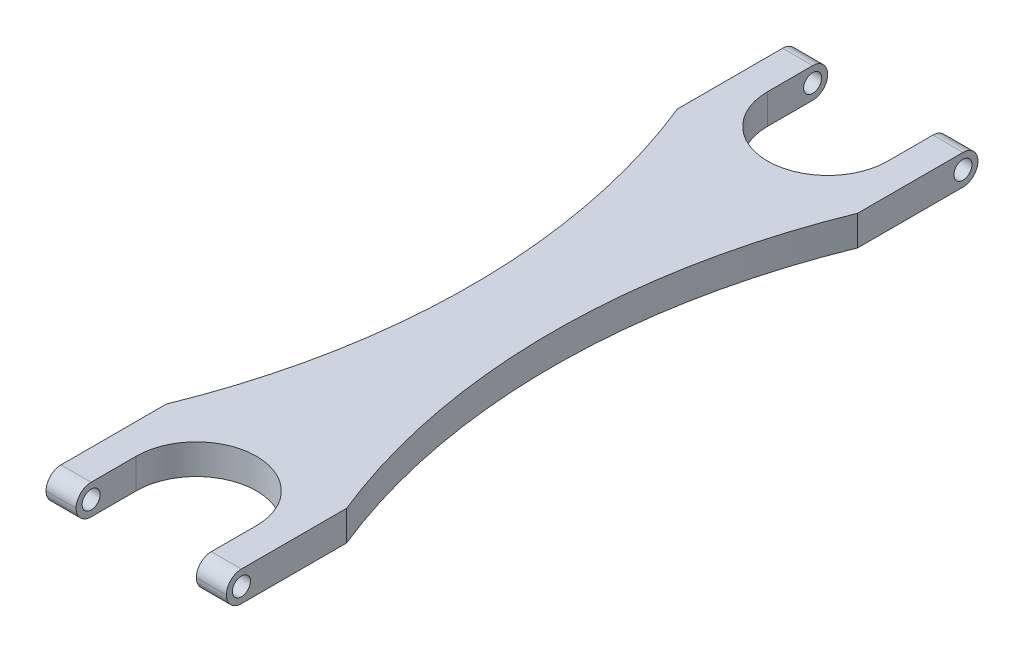
ISO-10303-21;
HEADER;
FILE_DESCRIPTION(('STEP AP214'),'2;1');
FILE_NAME('part.step','',(''),(''),'','','');
FILE_SCHEMA(('AUTOMOTIVE_DESIGN { 1 0 10303 214 1 1 1 1 }'));
ENDSEC;
DATA;
#1=APPLICATION_CONTEXT('core data for automotive mechanical design processes');
#2=APPLICATION_PROTOCOL_DEFINITION('international standard','automotive_design',2000,#1);
#3=PRODUCT_CONTEXT('',#1,'mechanical');
#4=PRODUCT('Part','Part','',(#3));
#5=PRODUCT_RELATED_PRODUCT_CATEGORY('part','',(#4));
#6=PRODUCT_DEFINITION_FORMATION('','',#4);
#7=PRODUCT_DEFINITION_CONTEXT('part definition',#1,'design');
#8=PRODUCT_DEFINITION('design','',#6,#7);
#9=PRODUCT_DEFINITION_SHAPE('','',#8);
#10=(LENGTH_UNIT() NAMED_UNIT(*) SI_UNIT(.MILLI.,.METRE.));
#11=(NAMED_UNIT(*) PLANE_ANGLE_UNIT() SI_UNIT($,.RADIAN.));
#12=(NAMED_UNIT(*) SI_UNIT($,.STERADIAN.) SOLID_ANGLE_UNIT());
#13=UNCERTAINTY_MEASURE_WITH_UNIT(LENGTH_MEASURE(1.E-05),#10,'distance_accuracy_value','');
#14=(GEOMETRIC_REPRESENTATION_CONTEXT(3) GLOBAL_UNCERTAINTY_ASSIGNED_CONTEXT((#13)) GLOBAL_UNIT_ASSIGNED_CONTEXT((#10,
#11,#12)) REPRESENTATION_CONTEXT('',''));
#15=CARTESIAN_POINT('',(0.,0.,0.));
#16=DIRECTION('',(0.,0.,1.));
#17=DIRECTION('',(1.,0.,0.));
#18=AXIS2_PLACEMENT_3D('',#15,#16,#17);
#19=CARTESIAN_POINT('',(0.,12.7,0.));
#20=DIRECTION('',(1.,0.,0.));
#21=DIRECTION('',(0.,0.,-1.));
#22=AXIS2_PLACEMENT_3D('',#19,#20,#21);
#23=PLANE('',#22);
#24=CARTESIAN_POINT('',(-1.11022302462516E-13,6.35,6.35000000000003));
#25=DIRECTION('',(1.,0.,0.));
#26=DIRECTION('',(0.,0.,-1.));
#27=AXIS2_PLACEMENT_3D('',#24,#25,#26);
#28=CIRCLE('',#27,3.81);
#29=CARTESIAN_POINT('',(-1.12410081243297E-13,6.35,2.54000000000003));
#30=VERTEX_POINT('',#29);
#31=EDGE_CURVE('E643',#30,#30,#28,.T.);
#32=ORIENTED_EDGE('',*,*,#31,.T.);
#33=EDGE_LOOP('',(#32));
#34=FACE_BOUND('',#33,.T.);
#35=CARTESIAN_POINT('',(0.,6.35,6.34999999999999));
#36=DIRECTION('',(1.,0.,0.));
#37=DIRECTION('',(0.,0.,-1.));
#38=AXIS2_PLACEMENT_3D('',#35,#36,#37);
#39=CIRCLE('',#38,6.35);
#40=CARTESIAN_POINT('',(0.,12.7,6.34999999999999));
#41=VERTEX_POINT('',#40);
#42=CARTESIAN_POINT('',(0.,6.35,0.));
#43=VERTEX_POINT('',#42);
#44=EDGE_CURVE('E221',#41,#43,#39,.F.);
#45=ORIENTED_EDGE('',*,*,#44,.T.);
#46=CARTESIAN_POINT('',(0.,6.35,6.35));
#47=DIRECTION('',(1.,0.,0.));
#48=DIRECTION('',(0.,0.,-1.));
#49=AXIS2_PLACEMENT_3D('',#46,#47,#48);
#50=CIRCLE('',#49,6.35);
#51=CARTESIAN_POINT('',(0.,0.,6.35));
#52=VERTEX_POINT('',#51);
#53=EDGE_CURVE('E223',#43,#52,#50,.F.);
#54=ORIENTED_EDGE('',*,*,#53,.T.);
#55=DIRECTION('',(0.,0.,1.));
#56=VECTOR('',#55,1.);
#57=CARTESIAN_POINT('',(0.,0.,0.));
#58=LINE('',#57,#56);
#59=CARTESIAN_POINT('',(0.,0.,50.8));
#60=VERTEX_POINT('',#59);
#61=EDGE_CURVE('E194',#52,#60,#58,.T.);
#62=ORIENTED_EDGE('',*,*,#61,.T.);
#63=DIRECTION('',(0.,-1.,0.));
#64=VECTOR('',#63,1.);
#65=CARTESIAN_POINT('',(0.,12.7,50.8));
#66=LINE('',#65,#64);
#67=CARTESIAN_POINT('',(0.,12.7,50.8));
#68=VERTEX_POINT('',#67);
#69=EDGE_CURVE('E187',#68,#60,#66,.T.);
#70=ORIENTED_EDGE('',*,*,#69,.F.);
#71=DIRECTION('',(0.,0.,1.));
#72=VECTOR('',#71,1.);
#73=CARTESIAN_POINT('',(0.,12.7,0.));
#74=LINE('',#73,#72);
#75=EDGE_CURVE('E169',#41,#68,#74,.T.);
#76=ORIENTED_EDGE('',*,*,#75,.F.);
#77=EDGE_LOOP('',(#45,#54,#62,#70,#76));
#78=FACE_BOUND('',#77,.T.);
#79=ADVANCED_FACE('F32',(#34,#78),#23,.F.);
#80=CARTESIAN_POINT('',(-266.7,12.7,158.75));
#81=DIRECTION('',(0.,-1.,0.));
#82=DIRECTION('',(0.,0.,-1.));
#83=AXIS2_PLACEMENT_3D('',#80,#81,#82);
#84=CYLINDRICAL_SURFACE('',#83,287.718773283913);
#85=CARTESIAN_POINT('',(-266.7,0.,158.75));
#86=DIRECTION('',(0.,-1.,0.));
#87=DIRECTION('',(0.,0.,-1.));
#88=AXIS2_PLACEMENT_3D('',#85,#86,#87);
#89=CIRCLE('',#88,287.718773283913);
#90=CARTESIAN_POINT('',(0.,0.,266.7));
#91=VERTEX_POINT('',#90);
#92=EDGE_CURVE('E293',#60,#91,#89,.T.);
#93=ORIENTED_EDGE('',*,*,#92,.T.);
#94=DIRECTION('',(0.,-1.,0.));
#95=VECTOR('',#94,1.);
#96=CARTESIAN_POINT('',(0.,12.7,266.7));
#97=LINE('',#96,#95);
#98=CARTESIAN_POINT('',(0.,12.7,266.7));
#99=VERTEX_POINT('',#98);
#100=EDGE_CURVE('E189',#99,#91,#97,.T.);
#101=ORIENTED_EDGE('',*,*,#100,.F.);
#102=CARTESIAN_POINT('',(-266.7,12.7,158.75));
#103=DIRECTION('',(0.,-1.,0.));
#104=DIRECTION('',(0.,0.,-1.));
#105=AXIS2_PLACEMENT_3D('',#102,#103,#104);
#106=CIRCLE('',#105,287.718773283913);
#107=EDGE_CURVE('E174',#68,#99,#106,.T.);
#108=ORIENTED_EDGE('',*,*,#107,.F.);
#109=ORIENTED_EDGE('',*,*,#69,.T.);
#110=EDGE_LOOP('',(#93,#101,#108,#109));
#111=FACE_BOUND('',#110,.T.);
#112=ADVANCED_FACE('F186',(#111),#84,.F.);
#113=CARTESIAN_POINT('',(0.,12.7,266.7));
#114=DIRECTION('',(1.,0.,0.));
#115=DIRECTION('',(0.,0.,-1.));
#116=AXIS2_PLACEMENT_3D('',#113,#114,#115);
#117=PLANE('',#116);
#118=CARTESIAN_POINT('',(0.,6.35,311.15));
#119=DIRECTION('',(1.,0.,0.));
#120=DIRECTION('',(0.,0.,-1.));
#121=AXIS2_PLACEMENT_3D('',#118,#119,#120);
#122=CIRCLE('',#121,3.81000000000004);
#123=CARTESIAN_POINT('',(0.,6.35,307.34));
#124=VERTEX_POINT('',#123);
#125=EDGE_CURVE('E267',#124,#124,#122,.T.);
#126=ORIENTED_EDGE('',*,*,#125,.T.);
#127=EDGE_LOOP('',(#126));
#128=FACE_BOUND('',#127,.T.);
#129=DIRECTION('',(0.,0.,1.));
#130=VECTOR('',#129,1.);
#131=CARTESIAN_POINT('',(0.,0.,266.7));
#132=LINE('',#131,#130);
#133=CARTESIAN_POINT('',(0.,0.,311.15));
#134=VERTEX_POINT('',#133);
#135=EDGE_CURVE('E295',#91,#134,#132,.T.);
#136=ORIENTED_EDGE('',*,*,#135,.T.);
#137=CARTESIAN_POINT('',(0.,6.35,311.15));
#138=DIRECTION('',(1.,0.,0.));
#139=DIRECTION('',(0.,0.,-1.));
#140=AXIS2_PLACEMENT_3D('',#137,#138,#139);
#141=CIRCLE('',#140,6.35);
#142=CARTESIAN_POINT('',(0.,6.35,317.5));
#143=VERTEX_POINT('',#142);
#144=EDGE_CURVE('E242',#134,#143,#141,.F.);
#145=ORIENTED_EDGE('',*,*,#144,.T.);
#146=CARTESIAN_POINT('',(0.,6.35,311.15));
#147=DIRECTION('',(1.,0.,0.));
#148=DIRECTION('',(0.,0.,-1.));
#149=AXIS2_PLACEMENT_3D('',#146,#147,#148);
#150=CIRCLE('',#149,6.35);
#151=CARTESIAN_POINT('',(0.,12.7,311.15));
#152=VERTEX_POINT('',#151);
#153=EDGE_CURVE('E240',#143,#152,#150,.F.);
#154=ORIENTED_EDGE('',*,*,#153,.T.);
#155=DIRECTION('',(0.,0.,1.));
#156=VECTOR('',#155,1.);
#157=CARTESIAN_POINT('',(0.,12.7,266.7));
#158=LINE('',#157,#156);
#159=EDGE_CURVE('E191',#99,#152,#158,.T.);
#160=ORIENTED_EDGE('',*,*,#159,.F.);
#161=ORIENTED_EDGE('',*,*,#100,.T.);
#162=EDGE_LOOP('',(#136,#145,#154,#160,#161));
#163=FACE_BOUND('',#162,.T.);
#164=ADVANCED_FACE('F396',(#128,#163),#117,.F.);
#165=CARTESIAN_POINT('',(12.7,12.7,317.5));
#166=DIRECTION('',(-1.,0.,0.));
#167=DIRECTION('',(0.,0.,1.));
#168=AXIS2_PLACEMENT_3D('',#165,#166,#167);
#169=PLANE('',#168);
#170=CARTESIAN_POINT('',(12.7,6.35,311.15));
#171=DIRECTION('',(-1.,0.,0.));
#172=DIRECTION('',(0.,0.,1.));
#173=AXIS2_PLACEMENT_3D('',#170,#171,#172);
#174=CIRCLE('',#173,3.81000000000004);
#175=CARTESIAN_POINT('',(12.7,6.35,314.96));
#176=VERTEX_POINT('',#175);
#177=EDGE_CURVE('E258',#176,#176,#174,.T.);
#178=ORIENTED_EDGE('',*,*,#177,.T.);
#179=EDGE_LOOP('',(#178));
#180=FACE_BOUND('',#179,.T.);
#181=CARTESIAN_POINT('',(12.7,6.35,311.15));
#182=DIRECTION('',(-1.,0.,0.));
#183=DIRECTION('',(0.,0.,1.));
#184=AXIS2_PLACEMENT_3D('',#181,#182,#183);
#185=CIRCLE('',#184,6.35);
#186=CARTESIAN_POINT('',(12.7,12.7,311.15));
#187=VERTEX_POINT('',#186);
#188=CARTESIAN_POINT('',(12.7,6.35,317.5));
#189=VERTEX_POINT('',#188);
#190=EDGE_CURVE('E236',#187,#189,#185,.F.);
#191=ORIENTED_EDGE('',*,*,#190,.T.);
#192=CARTESIAN_POINT('',(12.7,6.35,311.15));
#193=DIRECTION('',(-1.,0.,0.));
#194=DIRECTION('',(0.,0.,1.));
#195=AXIS2_PLACEMENT_3D('',#192,#193,#194);
#196=CIRCLE('',#195,6.35);
#197=CARTESIAN_POINT('',(12.7,0.,311.15));
#198=VERTEX_POINT('',#197);
#199=EDGE_CURVE('E238',#189,#198,#196,.F.);
#200=ORIENTED_EDGE('',*,*,#199,.T.);
#201=DIRECTION('',(0.,0.,-1.));
#202=VECTOR('',#201,1.);
#203=CARTESIAN_POINT('',(12.7,0.,317.5));
#204=LINE('',#203,#202);
#205=CARTESIAN_POINT('',(12.7,0.,292.1));
#206=VERTEX_POINT('',#205);
#207=EDGE_CURVE('E298',#198,#206,#204,.T.);
#208=ORIENTED_EDGE('',*,*,#207,.T.);
#209=DIRECTION('',(0.,-1.,0.));
#210=VECTOR('',#209,1.);
#211=CARTESIAN_POINT('',(12.7,12.7,292.1));
#212=LINE('',#211,#210);
#213=CARTESIAN_POINT('',(12.7,12.7,292.1));
#214=VERTEX_POINT('',#213);
#215=EDGE_CURVE('E200',#214,#206,#212,.T.);
#216=ORIENTED_EDGE('',*,*,#215,.F.);
#217=DIRECTION('',(0.,0.,-1.));
#218=VECTOR('',#217,1.);
#219=CARTESIAN_POINT('',(12.7,12.7,317.5));
#220=LINE('',#219,#218);
#221=EDGE_CURVE('E272',#187,#214,#220,.T.);
#222=ORIENTED_EDGE('',*,*,#221,.F.);
#223=EDGE_LOOP('',(#191,#200,#208,#216,#222));
#224=FACE_BOUND('',#223,.T.);
#225=ADVANCED_FACE('F339',(#180,#224),#169,.F.);
#226=CARTESIAN_POINT('',(38.1,12.7,292.1));
#227=DIRECTION('',(0.,-1.,0.));
#228=DIRECTION('',(0.,0.,-1.));
#229=AXIS2_PLACEMENT_3D('',#226,#227,#228);
#230=CYLINDRICAL_SURFACE('',#229,25.4);
#231=CARTESIAN_POINT('',(38.1,0.,292.1));
#232=DIRECTION('',(0.,-1.,0.));
#233=DIRECTION('',(0.,0.,1.));
#234=AXIS2_PLACEMENT_3D('',#231,#232,#233);
#235=CIRCLE('',#234,25.4);
#236=CARTESIAN_POINT('',(63.5,0.,292.1));
#237=VERTEX_POINT('',#236);
#238=EDGE_CURVE('E300',#206,#237,#235,.T.);
#239=ORIENTED_EDGE('',*,*,#238,.T.);
#240=DIRECTION('',(0.,-1.,0.));
#241=VECTOR('',#240,1.);
#242=CARTESIAN_POINT('',(63.5,12.7,292.1));
#243=LINE('',#242,#241);
#244=CARTESIAN_POINT('',(63.5,12.7,292.1));
#245=VERTEX_POINT('',#244);
#246=EDGE_CURVE('E328',#245,#237,#243,.T.);
#247=ORIENTED_EDGE('',*,*,#246,.F.);
#248=CARTESIAN_POINT('',(38.1,12.7,292.1));
#249=DIRECTION('',(0.,-1.,0.));
#250=DIRECTION('',(0.,0.,-1.));
#251=AXIS2_PLACEMENT_3D('',#248,#249,#250);
#252=CIRCLE('',#251,25.4);
#253=EDGE_CURVE('E274',#214,#245,#252,.T.);
#254=ORIENTED_EDGE('',*,*,#253,.F.);
#255=ORIENTED_EDGE('',*,*,#215,.T.);
#256=EDGE_LOOP('',(#239,#247,#254,#255));
#257=FACE_BOUND('',#256,.T.);
#258=ADVANCED_FACE('F334',(#257),#230,.F.);
#259=CARTESIAN_POINT('',(63.5,12.7,317.5));
#260=DIRECTION('',(1.,0.,0.));
#261=DIRECTION('',(0.,0.,-1.));
#262=AXIS2_PLACEMENT_3D('',#259,#260,#261);
#263=PLANE('',#262);
#264=CARTESIAN_POINT('',(63.5,6.35,311.15));
#265=DIRECTION('',(1.,0.,0.));
#266=DIRECTION('',(0.,0.,-1.));
#267=AXIS2_PLACEMENT_3D('',#264,#265,#266);
#268=CIRCLE('',#267,3.81000000000004);
#269=CARTESIAN_POINT('',(63.5,6.35,307.34));
#270=VERTEX_POINT('',#269);
#271=EDGE_CURVE('E262',#270,#270,#268,.T.);
#272=ORIENTED_EDGE('',*,*,#271,.T.);
#273=EDGE_LOOP('',(#272));
#274=FACE_BOUND('',#273,.T.);
#275=DIRECTION('',(0.,0.,1.));
#276=VECTOR('',#275,1.);
#277=CARTESIAN_POINT('',(63.5,0.,317.5));
#278=LINE('',#277,#276);
#279=CARTESIAN_POINT('',(63.5,0.,311.15));
#280=VERTEX_POINT('',#279);
#281=EDGE_CURVE('E302',#237,#280,#278,.T.);
#282=ORIENTED_EDGE('',*,*,#281,.T.);
#283=CARTESIAN_POINT('',(63.5,6.35,311.15));
#284=DIRECTION('',(1.,0.,0.));
#285=DIRECTION('',(0.,0.,-1.));
#286=AXIS2_PLACEMENT_3D('',#283,#284,#285);
#287=CIRCLE('',#286,6.35);
#288=CARTESIAN_POINT('',(63.5,6.35,317.5));
#289=VERTEX_POINT('',#288);
#290=EDGE_CURVE('E11',#280,#289,#287,.F.);
#291=ORIENTED_EDGE('',*,*,#290,.T.);
#292=CARTESIAN_POINT('',(63.5000000000001,6.35,311.15));
#293=DIRECTION('',(1.,0.,0.));
#294=DIRECTION('',(0.,0.,-1.));
#295=AXIS2_PLACEMENT_3D('',#292,#293,#294);
#296=CIRCLE('',#295,6.35);
#297=CARTESIAN_POINT('',(63.5,12.7,311.15));
#298=VERTEX_POINT('',#297);
#299=EDGE_CURVE('E41',#289,#298,#296,.F.);
#300=ORIENTED_EDGE('',*,*,#299,.T.);
#301=DIRECTION('',(0.,0.,1.));
#302=VECTOR('',#301,1.);
#303=CARTESIAN_POINT('',(63.5,12.7,317.5));
#304=LINE('',#303,#302);
#305=EDGE_CURVE('E276',#245,#298,#304,.T.);
#306=ORIENTED_EDGE('',*,*,#305,.F.);
#307=ORIENTED_EDGE('',*,*,#246,.T.);
#308=EDGE_LOOP('',(#282,#291,#300,#306,#307));
#309=FACE_BOUND('',#308,.T.);
#310=ADVANCED_FACE('F350',(#274,#309),#263,.F.);
#311=CARTESIAN_POINT('',(76.2000000000001,12.7,266.7));
#312=DIRECTION('',(-1.,0.,0.));
#313=DIRECTION('',(0.,0.,1.));
#314=AXIS2_PLACEMENT_3D('',#311,#312,#313);
#315=PLANE('',#314);
#316=CARTESIAN_POINT('',(76.2000000000001,6.35,311.15));
#317=DIRECTION('',(1.,0.,0.));
#318=DIRECTION('',(0.,0.,-1.));
#319=AXIS2_PLACEMENT_3D('',#316,#317,#318);
#320=CIRCLE('',#319,3.81000000000004);
#321=CARTESIAN_POINT('',(76.2000000000001,6.35,307.34));
#322=VERTEX_POINT('',#321);
#323=EDGE_CURVE('E639',#322,#322,#320,.T.);
#324=ORIENTED_EDGE('',*,*,#323,.F.);
#325=EDGE_LOOP('',(#324));
#326=FACE_BOUND('',#325,.T.);
#327=CARTESIAN_POINT('',(76.2,6.35,311.15));
#328=DIRECTION('',(-1.,0.,0.));
#329=DIRECTION('',(0.,0.,1.));
#330=AXIS2_PLACEMENT_3D('',#327,#328,#329);
#331=CIRCLE('',#330,6.35);
#332=CARTESIAN_POINT('',(76.2000000000001,12.7,311.15));
#333=VERTEX_POINT('',#332);
#334=CARTESIAN_POINT('',(76.2000000000001,6.35,317.5));
#335=VERTEX_POINT('',#334);
#336=EDGE_CURVE('E55',#333,#335,#331,.F.);
#337=ORIENTED_EDGE('',*,*,#336,.T.);
#338=CARTESIAN_POINT('',(76.2000000000001,6.35,311.15));
#339=DIRECTION('',(-1.,0.,0.));
#340=DIRECTION('',(0.,0.,1.));
#341=AXIS2_PLACEMENT_3D('',#338,#339,#340);
#342=CIRCLE('',#341,6.35);
#343=CARTESIAN_POINT('',(76.2000000000001,0.,311.15));
#344=VERTEX_POINT('',#343);
#345=EDGE_CURVE('E245',#335,#344,#342,.F.);
#346=ORIENTED_EDGE('',*,*,#345,.T.);
#347=DIRECTION('',(0.,0.,-1.));
#348=VECTOR('',#347,1.);
#349=CARTESIAN_POINT('',(76.2000000000001,0.,266.7));
#350=LINE('',#349,#348);
#351=CARTESIAN_POINT('',(76.2,0.,266.7));
#352=VERTEX_POINT('',#351);
#353=EDGE_CURVE('E304',#344,#352,#350,.T.);
#354=ORIENTED_EDGE('',*,*,#353,.T.);
#355=DIRECTION('',(0.,-1.,0.));
#356=VECTOR('',#355,1.);
#357=CARTESIAN_POINT('',(76.2,12.7,266.7));
#358=LINE('',#357,#356);
#359=CARTESIAN_POINT('',(76.2,12.7,266.7));
#360=VERTEX_POINT('',#359);
#361=EDGE_CURVE('E325',#360,#352,#358,.T.);
#362=ORIENTED_EDGE('',*,*,#361,.F.);
#363=DIRECTION('',(0.,0.,-1.));
#364=VECTOR('',#363,1.);
#365=CARTESIAN_POINT('',(76.2000000000001,12.7,266.7));
#366=LINE('',#365,#364);
#367=EDGE_CURVE('E279',#333,#360,#366,.T.);
#368=ORIENTED_EDGE('',*,*,#367,.F.);
#369=EDGE_LOOP('',(#337,#346,#354,#362,#368));
#370=FACE_BOUND('',#369,.T.);
#371=ADVANCED_FACE('F355',(#326,#370),#315,.F.);
#372=CARTESIAN_POINT('',(342.9,12.7,158.75));
#373=DIRECTION('',(0.,-1.,0.));
#374=DIRECTION('',(0.,0.,-1.));
#375=AXIS2_PLACEMENT_3D('',#372,#373,#374);
#376=CYLINDRICAL_SURFACE('',#375,287.718773283913);
#377=CARTESIAN_POINT('',(342.9,0.,158.75));
#378=DIRECTION('',(0.,-1.,0.));
#379=DIRECTION('',(0.,0.,1.));
#380=AXIS2_PLACEMENT_3D('',#377,#378,#379);
#381=CIRCLE('',#380,287.718773283913);
#382=CARTESIAN_POINT('',(76.2,0.,50.8));
#383=VERTEX_POINT('',#382);
#384=EDGE_CURVE('E306',#352,#383,#381,.T.);
#385=ORIENTED_EDGE('',*,*,#384,.T.);
#386=DIRECTION('',(0.,-1.,0.));
#387=VECTOR('',#386,1.);
#388=CARTESIAN_POINT('',(76.2,12.7,50.8));
#389=LINE('',#388,#387);
#390=CARTESIAN_POINT('',(76.2,12.7,50.8));
#391=VERTEX_POINT('',#390);
#392=EDGE_CURVE('E322',#391,#383,#389,.T.);
#393=ORIENTED_EDGE('',*,*,#392,.F.);
#394=CARTESIAN_POINT('',(342.9,12.7,158.75));
#395=DIRECTION('',(0.,-1.,0.));
#396=DIRECTION('',(0.,0.,1.));
#397=AXIS2_PLACEMENT_3D('',#394,#395,#396);
#398=CIRCLE('',#397,287.718773283913);
#399=EDGE_CURVE('E281',#360,#391,#398,.T.);
#400=ORIENTED_EDGE('',*,*,#399,.F.);
#401=ORIENTED_EDGE('',*,*,#361,.T.);
#402=EDGE_LOOP('',(#385,#393,#400,#401));
#403=FACE_BOUND('',#402,.T.);
#404=ADVANCED_FACE('F361',(#403),#376,.F.);
#405=CARTESIAN_POINT('',(76.2,12.7,0.));
#406=DIRECTION('',(-1.,0.,0.));
#407=DIRECTION('',(0.,0.,1.));
#408=AXIS2_PLACEMENT_3D('',#405,#406,#407);
#409=PLANE('',#408);
#410=CARTESIAN_POINT('',(76.2,6.35,6.35));
#411=DIRECTION('',(1.,0.,0.));
#412=DIRECTION('',(0.,0.,-1.));
#413=AXIS2_PLACEMENT_3D('',#410,#411,#412);
#414=CIRCLE('',#413,3.81);
#415=CARTESIAN_POINT('',(76.2,6.35,2.54));
#416=VERTEX_POINT('',#415);
#417=EDGE_CURVE('E635',#416,#416,#414,.T.);
#418=ORIENTED_EDGE('',*,*,#417,.F.);
#419=EDGE_LOOP('',(#418));
#420=FACE_BOUND('',#419,.T.);
#421=DIRECTION('',(0.,0.,-1.));
#422=VECTOR('',#421,1.);
#423=CARTESIAN_POINT('',(76.2,0.,0.));
#424=LINE('',#423,#422);
#425=CARTESIAN_POINT('',(76.2,0.,6.34999999999999));
#426=VERTEX_POINT('',#425);
#427=EDGE_CURVE('E308',#383,#426,#424,.T.);
#428=ORIENTED_EDGE('',*,*,#427,.T.);
#429=CARTESIAN_POINT('',(76.2,6.35,6.34999999999999));
#430=DIRECTION('',(-1.,0.,0.));
#431=DIRECTION('',(0.,0.,1.));
#432=AXIS2_PLACEMENT_3D('',#429,#430,#431);
#433=CIRCLE('',#432,6.35);
#434=CARTESIAN_POINT('',(76.2,6.35,0.));
#435=VERTEX_POINT('',#434);
#436=EDGE_CURVE('E219',#426,#435,#433,.F.);
#437=ORIENTED_EDGE('',*,*,#436,.T.);
#438=CARTESIAN_POINT('',(76.2,6.35,6.34999999999999));
#439=DIRECTION('',(-1.,0.,0.));
#440=DIRECTION('',(0.,0.,1.));
#441=AXIS2_PLACEMENT_3D('',#438,#439,#440);
#442=CIRCLE('',#441,6.35);
#443=CARTESIAN_POINT('',(76.2,12.7,6.34999999999999));
#444=VERTEX_POINT('',#443);
#445=EDGE_CURVE('E217',#435,#444,#442,.F.);
#446=ORIENTED_EDGE('',*,*,#445,.T.);
#447=DIRECTION('',(0.,0.,-1.));
#448=VECTOR('',#447,1.);
#449=CARTESIAN_POINT('',(76.2,12.7,0.));
#450=LINE('',#449,#448);
#451=EDGE_CURVE('E283',#391,#444,#450,.T.);
#452=ORIENTED_EDGE('',*,*,#451,.F.);
#453=ORIENTED_EDGE('',*,*,#392,.T.);
#454=EDGE_LOOP('',(#428,#437,#446,#452,#453));
#455=FACE_BOUND('',#454,.T.);
#456=ADVANCED_FACE('F365',(#420,#455),#409,.F.);
#457=CARTESIAN_POINT('',(63.5,12.7,0.));
#458=DIRECTION('',(1.,0.,0.));
#459=DIRECTION('',(0.,0.,-1.));
#460=AXIS2_PLACEMENT_3D('',#457,#458,#459);
#461=PLANE('',#460);
#462=CARTESIAN_POINT('',(63.5,6.35,6.35000000000001));
#463=DIRECTION('',(1.,0.,0.));
#464=DIRECTION('',(0.,0.,-1.));
#465=AXIS2_PLACEMENT_3D('',#462,#463,#464);
#466=CIRCLE('',#465,3.81);
#467=CARTESIAN_POINT('',(63.5,6.35,2.54000000000001));
#468=VERTEX_POINT('',#467);
#469=EDGE_CURVE('E638',#468,#468,#466,.T.);
#470=ORIENTED_EDGE('',*,*,#469,.T.);
#471=EDGE_LOOP('',(#470));
#472=FACE_BOUND('',#471,.T.);
#473=CARTESIAN_POINT('',(63.5,6.35,6.35));
#474=DIRECTION('',(1.,0.,0.));
#475=DIRECTION('',(0.,0.,-1.));
#476=AXIS2_PLACEMENT_3D('',#473,#474,#475);
#477=CIRCLE('',#476,6.35);
#478=CARTESIAN_POINT('',(63.5,12.7,6.35));
#479=VERTEX_POINT('',#478);
#480=CARTESIAN_POINT('',(63.5,6.35,0.));
#481=VERTEX_POINT('',#480);
#482=EDGE_CURVE('E196',#479,#481,#477,.F.);
#483=ORIENTED_EDGE('',*,*,#482,.T.);
#484=CARTESIAN_POINT('',(63.5,6.35,6.34999999999999));
#485=DIRECTION('',(1.,0.,0.));
#486=DIRECTION('',(0.,0.,-1.));
#487=AXIS2_PLACEMENT_3D('',#484,#485,#486);
#488=CIRCLE('',#487,6.35);
#489=CARTESIAN_POINT('',(63.5,0.,6.34999999999999));
#490=VERTEX_POINT('',#489);
#491=EDGE_CURVE('E198',#481,#490,#488,.F.);
#492=ORIENTED_EDGE('',*,*,#491,.T.);
#493=DIRECTION('',(0.,0.,1.));
#494=VECTOR('',#493,1.);
#495=CARTESIAN_POINT('',(63.5,0.,0.));
#496=LINE('',#495,#494);
#497=CARTESIAN_POINT('',(63.5,0.,25.4));
#498=VERTEX_POINT('',#497);
#499=EDGE_CURVE('E311',#490,#498,#496,.T.);
#500=ORIENTED_EDGE('',*,*,#499,.T.);
#501=DIRECTION('',(0.,-1.,0.));
#502=VECTOR('',#501,1.);
#503=CARTESIAN_POINT('',(63.5,12.7,25.4));
#504=LINE('',#503,#502);
#505=CARTESIAN_POINT('',(63.5,12.7,25.4));
#506=VERTEX_POINT('',#505);
#507=EDGE_CURVE('E319',#506,#498,#504,.T.);
#508=ORIENTED_EDGE('',*,*,#507,.F.);
#509=DIRECTION('',(0.,0.,1.));
#510=VECTOR('',#509,1.);
#511=CARTESIAN_POINT('',(63.5,12.7,0.));
#512=LINE('',#511,#510);
#513=EDGE_CURVE('E285',#479,#506,#512,.T.);
#514=ORIENTED_EDGE('',*,*,#513,.F.);
#515=EDGE_LOOP('',(#483,#492,#500,#508,#514));
#516=FACE_BOUND('',#515,.T.);
#517=ADVANCED_FACE('F375',(#472,#516),#461,.F.);
#518=CARTESIAN_POINT('',(38.1,12.7,25.4));
#519=DIRECTION('',(0.,-1.,0.));
#520=DIRECTION('',(0.,0.,-1.));
#521=AXIS2_PLACEMENT_3D('',#518,#519,#520);
#522=CYLINDRICAL_SURFACE('',#521,25.4);
#523=CARTESIAN_POINT('',(38.1,0.,25.4));
#524=DIRECTION('',(0.,-1.,0.));
#525=DIRECTION('',(0.,0.,1.));
#526=AXIS2_PLACEMENT_3D('',#523,#524,#525);
#527=CIRCLE('',#526,25.4);
#528=CARTESIAN_POINT('',(12.7,0.,25.4));
#529=VERTEX_POINT('',#528);
#530=EDGE_CURVE('E313',#498,#529,#527,.T.);
#531=ORIENTED_EDGE('',*,*,#530,.T.);
#532=DIRECTION('',(0.,-1.,0.));
#533=VECTOR('',#532,1.);
#534=CARTESIAN_POINT('',(12.7,12.7,25.4));
#535=LINE('',#534,#533);
#536=CARTESIAN_POINT('',(12.7,12.7,25.4));
#537=VERTEX_POINT('',#536);
#538=EDGE_CURVE('E291',#537,#529,#535,.T.);
#539=ORIENTED_EDGE('',*,*,#538,.F.);
#540=CARTESIAN_POINT('',(38.1,12.7,25.4));
#541=DIRECTION('',(0.,-1.,0.));
#542=DIRECTION('',(0.,0.,-1.));
#543=AXIS2_PLACEMENT_3D('',#540,#541,#542);
#544=CIRCLE('',#543,25.4);
#545=EDGE_CURVE('E287',#506,#537,#544,.T.);
#546=ORIENTED_EDGE('',*,*,#545,.F.);
#547=ORIENTED_EDGE('',*,*,#507,.T.);
#548=EDGE_LOOP('',(#531,#539,#546,#547));
#549=FACE_BOUND('',#548,.T.);
#550=ADVANCED_FACE('F381',(#549),#522,.F.);
#551=CARTESIAN_POINT('',(12.7,12.7,0.));
#552=DIRECTION('',(-1.,0.,0.));
#553=DIRECTION('',(0.,0.,1.));
#554=AXIS2_PLACEMENT_3D('',#551,#552,#553);
#555=PLANE('',#554);
#556=CARTESIAN_POINT('',(12.7,6.35,6.35000000000003));
#557=DIRECTION('',(-1.,0.,0.));
#558=DIRECTION('',(0.,0.,1.));
#559=AXIS2_PLACEMENT_3D('',#556,#557,#558);
#560=CIRCLE('',#559,3.81);
#561=CARTESIAN_POINT('',(12.7,6.35,10.16));
#562=VERTEX_POINT('',#561);
#563=EDGE_CURVE('E36',#562,#562,#560,.T.);
#564=ORIENTED_EDGE('',*,*,#563,.T.);
#565=EDGE_LOOP('',(#564));
#566=FACE_BOUND('',#565,.T.);
#567=DIRECTION('',(0.,0.,-1.));
#568=VECTOR('',#567,1.);
#569=CARTESIAN_POINT('',(12.7,0.,0.));
#570=LINE('',#569,#568);
#571=CARTESIAN_POINT('',(12.7,0.,6.35));
#572=VERTEX_POINT('',#571);
#573=EDGE_CURVE('E182',#529,#572,#570,.T.);
#574=ORIENTED_EDGE('',*,*,#573,.T.);
#575=CARTESIAN_POINT('',(12.7,6.35,6.35));
#576=DIRECTION('',(-1.,0.,0.));
#577=DIRECTION('',(0.,0.,1.));
#578=AXIS2_PLACEMENT_3D('',#575,#576,#577);
#579=CIRCLE('',#578,6.35);
#580=CARTESIAN_POINT('',(12.7,6.35,0.));
#581=VERTEX_POINT('',#580);
#582=EDGE_CURVE('E227',#572,#581,#579,.F.);
#583=ORIENTED_EDGE('',*,*,#582,.T.);
#584=CARTESIAN_POINT('',(12.7,6.35,6.34999999999999));
#585=DIRECTION('',(-1.,0.,0.));
#586=DIRECTION('',(0.,0.,1.));
#587=AXIS2_PLACEMENT_3D('',#584,#585,#586);
#588=CIRCLE('',#587,6.35);
#589=CARTESIAN_POINT('',(12.7,12.7,6.34999999999999));
#590=VERTEX_POINT('',#589);
#591=EDGE_CURVE('E225',#581,#590,#588,.F.);
#592=ORIENTED_EDGE('',*,*,#591,.T.);
#593=DIRECTION('',(0.,0.,-1.));
#594=VECTOR('',#593,1.);
#595=CARTESIAN_POINT('',(12.7,12.7,0.));
#596=LINE('',#595,#594);
#597=EDGE_CURVE('E289',#537,#590,#596,.T.);
#598=ORIENTED_EDGE('',*,*,#597,.F.);
#599=ORIENTED_EDGE('',*,*,#538,.T.);
#600=EDGE_LOOP('',(#574,#583,#592,#598,#599));
#601=FACE_BOUND('',#600,.T.);
#602=ADVANCED_FACE('F385',(#566,#601),#555,.F.);
#603=CARTESIAN_POINT('',(-266.7,12.7,158.75));
#604=DIRECTION('',(0.,-1.,0.));
#605=DIRECTION('',(0.,0.,-1.));
#606=AXIS2_PLACEMENT_3D('',#603,#604,#605);
#607=PLANE('',#606);
#608=ORIENTED_EDGE('',*,*,#451,.T.);
#609=DIRECTION('',(-1.,0.,0.));
#610=VECTOR('',#609,1.);
#611=CARTESIAN_POINT('',(-266.7,12.7,6.35000000000008));
#612=LINE('',#611,#610);
#613=EDGE_CURVE('E234',#444,#479,#612,.T.);
#614=ORIENTED_EDGE('',*,*,#613,.T.);
#615=ORIENTED_EDGE('',*,*,#513,.T.);
#616=ORIENTED_EDGE('',*,*,#545,.T.);
#617=ORIENTED_EDGE('',*,*,#597,.T.);
#618=DIRECTION('',(-1.,0.,0.));
#619=VECTOR('',#618,1.);
#620=CARTESIAN_POINT('',(-266.7,12.7,6.34999999999999));
#621=LINE('',#620,#619);
#622=EDGE_CURVE('E178',#590,#41,#621,.T.);
#623=ORIENTED_EDGE('',*,*,#622,.T.);
#624=ORIENTED_EDGE('',*,*,#75,.T.);
#625=ORIENTED_EDGE('',*,*,#107,.T.);
#626=ORIENTED_EDGE('',*,*,#159,.T.);
#627=DIRECTION('',(1.,0.,0.));
#628=VECTOR('',#627,1.);
#629=CARTESIAN_POINT('',(-266.7,12.7,311.15));
#630=LINE('',#629,#628);
#631=EDGE_CURVE('E231',#152,#187,#630,.T.);
#632=ORIENTED_EDGE('',*,*,#631,.T.);
#633=ORIENTED_EDGE('',*,*,#221,.T.);
#634=ORIENTED_EDGE('',*,*,#253,.T.);
#635=ORIENTED_EDGE('',*,*,#305,.T.);
#636=DIRECTION('',(1.,0.,0.));
#637=VECTOR('',#636,1.);
#638=CARTESIAN_POINT('',(-266.7,12.7,311.15));
#639=LINE('',#638,#637);
#640=EDGE_CURVE('E229',#298,#333,#639,.T.);
#641=ORIENTED_EDGE('',*,*,#640,.T.);
#642=ORIENTED_EDGE('',*,*,#367,.T.);
#643=ORIENTED_EDGE('',*,*,#399,.T.);
#644=EDGE_LOOP('',(#608,#614,#615,#616,#617,#623,#624,#625,#626,#632,#633,#634,#635,#641,#642,#643));
#645=FACE_BOUND('',#644,.T.);
#646=ADVANCED_FACE('F172',(#645),#607,.F.);
#647=CARTESIAN_POINT('',(-266.7,0.,158.75));
#648=DIRECTION('',(0.,-1.,0.));
#649=DIRECTION('',(0.,0.,-1.));
#650=AXIS2_PLACEMENT_3D('',#647,#648,#649);
#651=PLANE('',#650);
#652=ORIENTED_EDGE('',*,*,#499,.F.);
#653=DIRECTION('',(-1.,0.,0.));
#654=VECTOR('',#653,1.);
#655=CARTESIAN_POINT('',(76.2,0.,6.34999999999999));
#656=LINE('',#655,#654);
#657=EDGE_CURVE('E214',#490,#426,#656,.F.);
#658=ORIENTED_EDGE('',*,*,#657,.T.);
#659=ORIENTED_EDGE('',*,*,#427,.F.);
#660=ORIENTED_EDGE('',*,*,#384,.F.);
#661=ORIENTED_EDGE('',*,*,#353,.F.);
#662=DIRECTION('',(1.,0.,0.));
#663=VECTOR('',#662,1.);
#664=CARTESIAN_POINT('',(63.5,0.,311.15));
#665=LINE('',#664,#663);
#666=EDGE_CURVE('E205',#344,#280,#665,.F.);
#667=ORIENTED_EDGE('',*,*,#666,.T.);
#668=ORIENTED_EDGE('',*,*,#281,.F.);
#669=ORIENTED_EDGE('',*,*,#238,.F.);
#670=ORIENTED_EDGE('',*,*,#207,.F.);
#671=DIRECTION('',(1.,0.,0.));
#672=VECTOR('',#671,1.);
#673=CARTESIAN_POINT('',(0.,0.,311.15));
#674=LINE('',#673,#672);
#675=EDGE_CURVE('E208',#198,#134,#674,.F.);
#676=ORIENTED_EDGE('',*,*,#675,.T.);
#677=ORIENTED_EDGE('',*,*,#135,.F.);
#678=ORIENTED_EDGE('',*,*,#92,.F.);
#679=ORIENTED_EDGE('',*,*,#61,.F.);
#680=DIRECTION('',(-1.,0.,0.));
#681=VECTOR('',#680,1.);
#682=CARTESIAN_POINT('',(12.7,0.,6.35));
#683=LINE('',#682,#681);
#684=EDGE_CURVE('E211',#52,#572,#683,.F.);
#685=ORIENTED_EDGE('',*,*,#684,.T.);
#686=ORIENTED_EDGE('',*,*,#573,.F.);
#687=ORIENTED_EDGE('',*,*,#530,.F.);
#688=EDGE_LOOP('',(#652,#658,#659,#660,#661,#667,#668,#669,#670,#676,#677,#678,#679,#685,#686,#687));
#689=FACE_BOUND('',#688,.T.);
#690=ADVANCED_FACE('F347',(#689),#651,.T.);
#691=CARTESIAN_POINT('',(-266.7,6.35,6.35000000000008));
#692=DIRECTION('',(-1.,0.,0.));
#693=DIRECTION('',(0.,0.,1.));
#694=AXIS2_PLACEMENT_3D('',#691,#692,#693);
#695=CYLINDRICAL_SURFACE('',#694,6.35);
#696=ORIENTED_EDGE('',*,*,#613,.F.);
#697=ORIENTED_EDGE('',*,*,#445,.F.);
#698=DIRECTION('',(-1.,0.,0.));
#699=VECTOR('',#698,1.);
#700=CARTESIAN_POINT('',(76.2,6.35,0.));
#701=LINE('',#700,#699);
#702=EDGE_CURVE('E248',#481,#435,#701,.F.);
#703=ORIENTED_EDGE('',*,*,#702,.F.);
#704=ORIENTED_EDGE('',*,*,#482,.F.);
#705=EDGE_LOOP('',(#696,#697,#703,#704));
#706=FACE_BOUND('',#705,.T.);
#707=ADVANCED_FACE('F371',(#706),#695,.T.);
#708=CARTESIAN_POINT('',(76.2,6.35,6.34999999999999));
#709=DIRECTION('',(1.,0.,0.));
#710=DIRECTION('',(0.,0.,-1.));
#711=AXIS2_PLACEMENT_3D('',#708,#709,#710);
#712=CYLINDRICAL_SURFACE('',#711,6.35);
#713=ORIENTED_EDGE('',*,*,#436,.F.);
#714=ORIENTED_EDGE('',*,*,#657,.F.);
#715=ORIENTED_EDGE('',*,*,#491,.F.);
#716=ORIENTED_EDGE('',*,*,#702,.T.);
#717=EDGE_LOOP('',(#713,#714,#715,#716));
#718=FACE_BOUND('',#717,.T.);
#719=ADVANCED_FACE('F422',(#718),#712,.T.);
#720=CARTESIAN_POINT('',(-266.7,6.35,6.34999999999999));
#721=DIRECTION('',(-1.,0.,0.));
#722=DIRECTION('',(0.,0.,1.));
#723=AXIS2_PLACEMENT_3D('',#720,#721,#722);
#724=CYLINDRICAL_SURFACE('',#723,6.35);
#725=ORIENTED_EDGE('',*,*,#622,.F.);
#726=ORIENTED_EDGE('',*,*,#591,.F.);
#727=DIRECTION('',(-1.,0.,0.));
#728=VECTOR('',#727,1.);
#729=CARTESIAN_POINT('',(0.,6.35,0.));
#730=LINE('',#729,#728);
#731=EDGE_CURVE('E251',#43,#581,#730,.F.);
#732=ORIENTED_EDGE('',*,*,#731,.F.);
#733=ORIENTED_EDGE('',*,*,#44,.F.);
#734=EDGE_LOOP('',(#725,#726,#732,#733));
#735=FACE_BOUND('',#734,.T.);
#736=ADVANCED_FACE('F389',(#735),#724,.T.);
#737=CARTESIAN_POINT('',(0.,6.35,6.35));
#738=DIRECTION('',(1.,0.,0.));
#739=DIRECTION('',(0.,0.,-1.));
#740=AXIS2_PLACEMENT_3D('',#737,#738,#739);
#741=CYLINDRICAL_SURFACE('',#740,6.35);
#742=ORIENTED_EDGE('',*,*,#582,.F.);
#743=ORIENTED_EDGE('',*,*,#684,.F.);
#744=ORIENTED_EDGE('',*,*,#53,.F.);
#745=ORIENTED_EDGE('',*,*,#731,.T.);
#746=EDGE_LOOP('',(#742,#743,#744,#745));
#747=FACE_BOUND('',#746,.T.);
#748=ADVANCED_FACE('F392',(#747),#741,.T.);
#749=CARTESIAN_POINT('',(-266.7,6.35,311.15));
#750=DIRECTION('',(1.,0.,0.));
#751=DIRECTION('',(0.,0.,-1.));
#752=AXIS2_PLACEMENT_3D('',#749,#750,#751);
#753=CYLINDRICAL_SURFACE('',#752,6.35);
#754=ORIENTED_EDGE('',*,*,#631,.F.);
#755=ORIENTED_EDGE('',*,*,#153,.F.);
#756=DIRECTION('',(1.,0.,0.));
#757=VECTOR('',#756,1.);
#758=CARTESIAN_POINT('',(0.,6.35,317.5));
#759=LINE('',#758,#757);
#760=EDGE_CURVE('E254',#189,#143,#759,.F.);
#761=ORIENTED_EDGE('',*,*,#760,.F.);
#762=ORIENTED_EDGE('',*,*,#190,.F.);
#763=EDGE_LOOP('',(#754,#755,#761,#762));
#764=FACE_BOUND('',#763,.T.);
#765=ADVANCED_FACE('F400',(#764),#753,.T.);
#766=CARTESIAN_POINT('',(0.,6.35,311.15));
#767=DIRECTION('',(-1.,0.,0.));
#768=DIRECTION('',(0.,0.,1.));
#769=AXIS2_PLACEMENT_3D('',#766,#767,#768);
#770=CYLINDRICAL_SURFACE('',#769,6.35);
#771=ORIENTED_EDGE('',*,*,#144,.F.);
#772=ORIENTED_EDGE('',*,*,#675,.F.);
#773=ORIENTED_EDGE('',*,*,#199,.F.);
#774=ORIENTED_EDGE('',*,*,#760,.T.);
#775=EDGE_LOOP('',(#771,#772,#773,#774));
#776=FACE_BOUND('',#775,.T.);
#777=ADVANCED_FACE('F403',(#776),#770,.T.);
#778=CARTESIAN_POINT('',(-266.7,6.35,311.15));
#779=DIRECTION('',(1.,0.,0.));
#780=DIRECTION('',(0.,0.,-1.));
#781=AXIS2_PLACEMENT_3D('',#778,#779,#780);
#782=CYLINDRICAL_SURFACE('',#781,6.35);
#783=ORIENTED_EDGE('',*,*,#640,.F.);
#784=ORIENTED_EDGE('',*,*,#299,.F.);
#785=DIRECTION('',(1.,0.,0.));
#786=VECTOR('',#785,1.);
#787=CARTESIAN_POINT('',(76.2000000000001,6.35,317.5));
#788=LINE('',#787,#786);
#789=EDGE_CURVE('E256',#335,#289,#788,.F.);
#790=ORIENTED_EDGE('',*,*,#789,.F.);
#791=ORIENTED_EDGE('',*,*,#336,.F.);
#792=EDGE_LOOP('',(#783,#784,#790,#791));
#793=FACE_BOUND('',#792,.T.);
#794=ADVANCED_FACE('F34',(#793),#782,.T.);
#795=CARTESIAN_POINT('',(76.2000000000001,6.35,311.15));
#796=DIRECTION('',(-1.,0.,0.));
#797=DIRECTION('',(0.,0.,1.));
#798=AXIS2_PLACEMENT_3D('',#795,#796,#797);
#799=CYLINDRICAL_SURFACE('',#798,6.35);
#800=ORIENTED_EDGE('',*,*,#290,.F.);
#801=ORIENTED_EDGE('',*,*,#666,.F.);
#802=ORIENTED_EDGE('',*,*,#345,.F.);
#803=ORIENTED_EDGE('',*,*,#789,.T.);
#804=EDGE_LOOP('',(#800,#801,#802,#803));
#805=FACE_BOUND('',#804,.T.);
#806=ADVANCED_FACE('F354',(#805),#799,.T.);
#807=CARTESIAN_POINT('',(0.,6.35,311.15));
#808=DIRECTION('',(1.,0.,0.));
#809=DIRECTION('',(0.,0.,-1.));
#810=AXIS2_PLACEMENT_3D('',#807,#808,#809);
#811=CYLINDRICAL_SURFACE('',#810,3.81000000000004);
#812=ORIENTED_EDGE('',*,*,#323,.T.);
#813=EDGE_LOOP('',(#812));
#814=FACE_BOUND('',#813,.T.);
#815=ORIENTED_EDGE('',*,*,#271,.F.);
#816=EDGE_LOOP('',(#815));
#817=FACE_BOUND('',#816,.T.);
#818=ADVANCED_FACE('F461',(#814,#817),#811,.F.);
#819=ORIENTED_EDGE('',*,*,#125,.F.);
#820=EDGE_LOOP('',(#819));
#821=FACE_BOUND('',#820,.T.);
#822=ORIENTED_EDGE('',*,*,#177,.F.);
#823=EDGE_LOOP('',(#822));
#824=FACE_BOUND('',#823,.T.);
#825=ADVANCED_FACE('F509',(#821,#824),#811,.F.);
#826=CARTESIAN_POINT('',(-1.11022302462516E-13,6.35,6.35000000000003));
#827=DIRECTION('',(1.,0.,0.));
#828=DIRECTION('',(0.,0.,-1.));
#829=AXIS2_PLACEMENT_3D('',#826,#827,#828);
#830=CYLINDRICAL_SURFACE('',#829,3.81);
#831=ORIENTED_EDGE('',*,*,#31,.F.);
#832=EDGE_LOOP('',(#831));
#833=FACE_BOUND('',#832,.T.);
#834=ORIENTED_EDGE('',*,*,#563,.F.);
#835=EDGE_LOOP('',(#834));
#836=FACE_BOUND('',#835,.T.);
#837=ADVANCED_FACE('F518',(#833,#836),#830,.F.);
#838=ORIENTED_EDGE('',*,*,#417,.T.);
#839=EDGE_LOOP('',(#838));
#840=FACE_BOUND('',#839,.T.);
#841=ORIENTED_EDGE('',*,*,#469,.F.);
#842=EDGE_LOOP('',(#841));
#843=FACE_BOUND('',#842,.T.);
#844=ADVANCED_FACE('F564',(#840,#843),#830,.F.);
#845=CLOSED_SHELL('',(#79,#112,#164,#225,#258,#310,#371,#404,#456,#517,#550,#602,#646,#690,#707,
#719,#736,#748,#765,#777,#794,#806,#818,#825,#837,#844));
#846=MANIFOLD_SOLID_BREP('B2',#845);
#847=ADVANCED_BREP_SHAPE_REPRESENTATION('',(#18,#846),#14);
#848=SHAPE_DEFINITION_REPRESENTATION(#9,#847);
ENDSEC;
END-ISO-10303-21;
